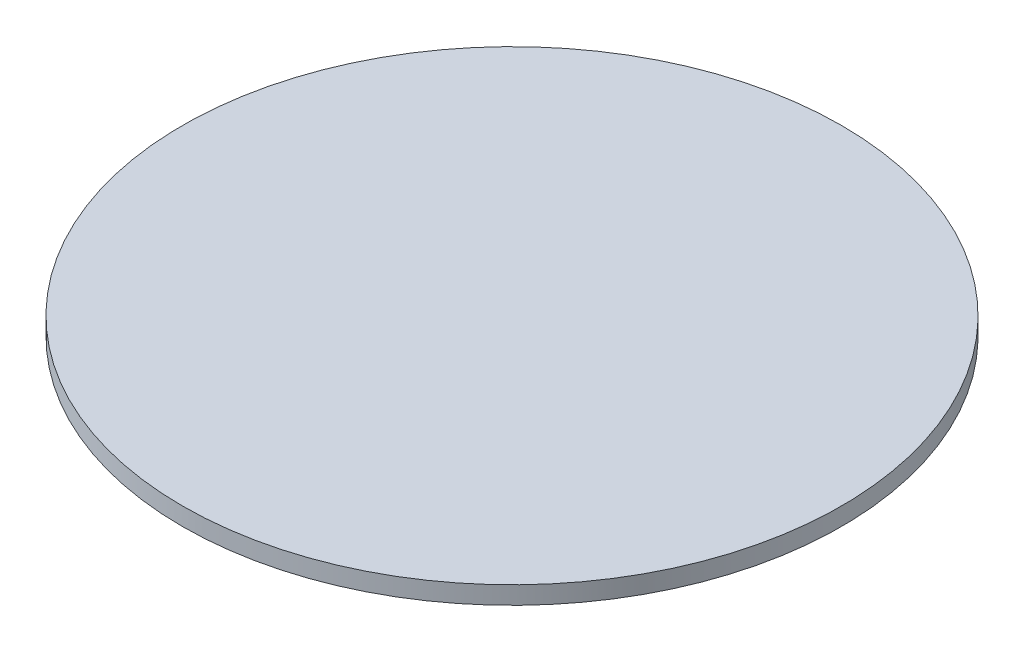
ISO-10303-21;
HEADER;
FILE_DESCRIPTION(('STEP AP214'),'2;1');
FILE_NAME('part.step','',(''),(''),'','','');
FILE_SCHEMA(('AUTOMOTIVE_DESIGN { 1 0 10303 214 1 1 1 1 }'));
ENDSEC;
DATA;
#1=APPLICATION_CONTEXT('core data for automotive mechanical design processes');
#2=APPLICATION_PROTOCOL_DEFINITION('international standard','automotive_design',2000,#1);
#3=PRODUCT_CONTEXT('',#1,'mechanical');
#4=PRODUCT('Part','Part','',(#3));
#5=PRODUCT_RELATED_PRODUCT_CATEGORY('part','',(#4));
#6=PRODUCT_DEFINITION_FORMATION('','',#4);
#7=PRODUCT_DEFINITION_CONTEXT('part definition',#1,'design');
#8=PRODUCT_DEFINITION('design','',#6,#7);
#9=PRODUCT_DEFINITION_SHAPE('','',#8);
#10=(LENGTH_UNIT() NAMED_UNIT(*) SI_UNIT(.MILLI.,.METRE.));
#11=(NAMED_UNIT(*) PLANE_ANGLE_UNIT() SI_UNIT($,.RADIAN.));
#12=(NAMED_UNIT(*) SI_UNIT($,.STERADIAN.) SOLID_ANGLE_UNIT());
#13=UNCERTAINTY_MEASURE_WITH_UNIT(LENGTH_MEASURE(1.E-05),#10,'distance_accuracy_value','');
#14=(GEOMETRIC_REPRESENTATION_CONTEXT(3) GLOBAL_UNCERTAINTY_ASSIGNED_CONTEXT((#13)) GLOBAL_UNIT_ASSIGNED_CONTEXT((#10,
#11,#12)) REPRESENTATION_CONTEXT('',''));
#15=CARTESIAN_POINT('',(0.,0.,0.));
#16=DIRECTION('',(0.,0.,1.));
#17=DIRECTION('',(1.,0.,0.));
#18=AXIS2_PLACEMENT_3D('',#15,#16,#17);
#19=CARTESIAN_POINT('',(0.,1.,0.));
#20=DIRECTION('',(0.,-1.,0.));
#21=DIRECTION('',(0.,0.,-1.));
#22=AXIS2_PLACEMENT_3D('',#19,#20,#21);
#23=CYLINDRICAL_SURFACE('',#22,18.5);
#24=CARTESIAN_POINT('',(0.,1.,0.));
#25=DIRECTION('',(0.,1.,0.));
#26=DIRECTION('',(0.,0.,1.));
#27=AXIS2_PLACEMENT_3D('',#24,#25,#26);
#28=CIRCLE('',#27,18.5);
#29=CARTESIAN_POINT('',(0.,1.,18.5));
#30=VERTEX_POINT('',#29);
#31=EDGE_CURVE('E10',#30,#30,#28,.T.);
#32=ORIENTED_EDGE('',*,*,#31,.F.);
#33=EDGE_LOOP('',(#32));
#34=FACE_BOUND('',#33,.T.);
#35=CARTESIAN_POINT('',(0.,0.,0.));
#36=DIRECTION('',(0.,1.,0.));
#37=DIRECTION('',(0.,0.,1.));
#38=AXIS2_PLACEMENT_3D('',#35,#36,#37);
#39=CIRCLE('',#38,18.5);
#40=CARTESIAN_POINT('',(0.,0.,18.5));
#41=VERTEX_POINT('',#40);
#42=EDGE_CURVE('E35',#41,#41,#39,.T.);
#43=ORIENTED_EDGE('',*,*,#42,.T.);
#44=EDGE_LOOP('',(#43));
#45=FACE_BOUND('',#44,.T.);
#46=ADVANCED_FACE('F32',(#34,#45),#23,.T.);
#47=CARTESIAN_POINT('',(0.,1.,0.));
#48=DIRECTION('',(0.,1.,0.));
#49=DIRECTION('',(0.,0.,1.));
#50=AXIS2_PLACEMENT_3D('',#47,#48,#49);
#51=PLANE('',#50);
#52=ORIENTED_EDGE('',*,*,#31,.T.);
#53=EDGE_LOOP('',(#52));
#54=FACE_BOUND('',#53,.T.);
#55=ADVANCED_FACE('F47',(#54),#51,.T.);
#56=CARTESIAN_POINT('',(0.,0.,0.));
#57=DIRECTION('',(0.,1.,0.));
#58=DIRECTION('',(0.,0.,1.));
#59=AXIS2_PLACEMENT_3D('',#56,#57,#58);
#60=PLANE('',#59);
#61=ORIENTED_EDGE('',*,*,#42,.F.);
#62=EDGE_LOOP('',(#61));
#63=FACE_BOUND('',#62,.T.);
#64=ADVANCED_FACE('F45',(#63),#60,.F.);
#65=CLOSED_SHELL('',(#46,#55,#64));
#66=MANIFOLD_SOLID_BREP('B2',#65);
#67=ADVANCED_BREP_SHAPE_REPRESENTATION('',(#18,#66),#14);
#68=SHAPE_DEFINITION_REPRESENTATION(#9,#67);
ENDSEC;
END-ISO-10303-21;
